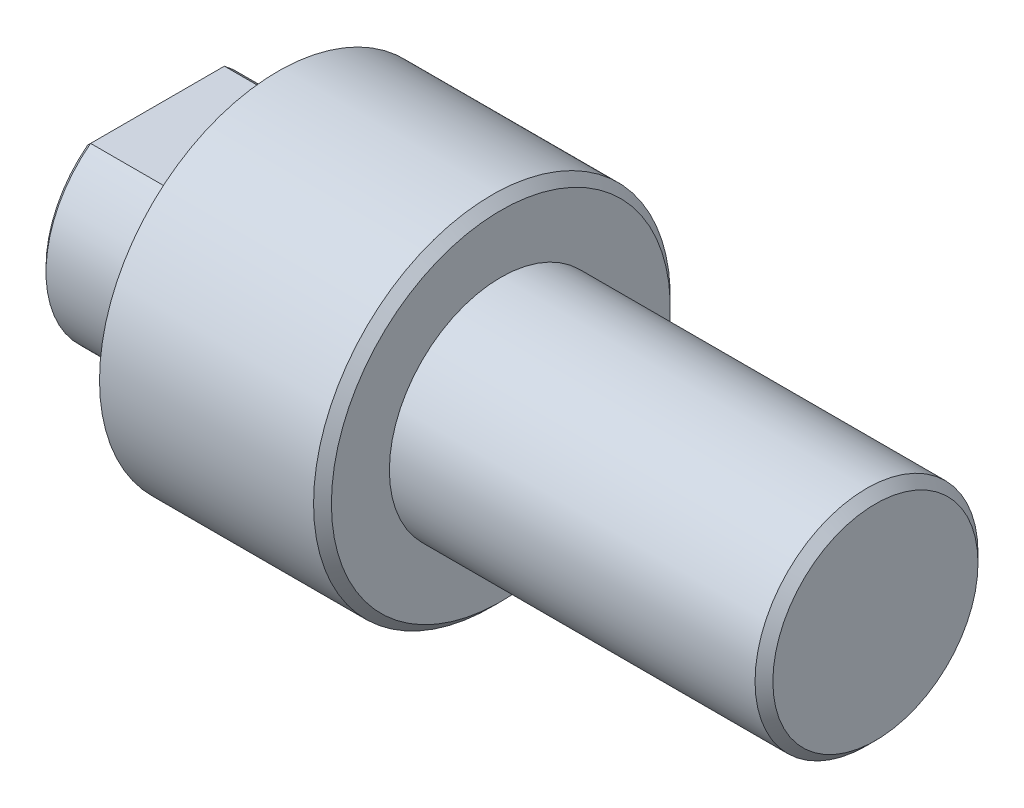
ISO-10303-21;
HEADER;
FILE_DESCRIPTION(('STEP AP214'),'2;1');
FILE_NAME('part.step','',(''),(''),'','','');
FILE_SCHEMA(('AUTOMOTIVE_DESIGN { 1 0 10303 214 1 1 1 1 }'));
ENDSEC;
DATA;
#1=APPLICATION_CONTEXT('core data for automotive mechanical design processes');
#2=APPLICATION_PROTOCOL_DEFINITION('international standard','automotive_design',2000,#1);
#3=PRODUCT_CONTEXT('',#1,'mechanical');
#4=PRODUCT('Part','Part','',(#3));
#5=PRODUCT_RELATED_PRODUCT_CATEGORY('part','',(#4));
#6=PRODUCT_DEFINITION_FORMATION('','',#4);
#7=PRODUCT_DEFINITION_CONTEXT('part definition',#1,'design');
#8=PRODUCT_DEFINITION('design','',#6,#7);
#9=PRODUCT_DEFINITION_SHAPE('','',#8);
#10=(LENGTH_UNIT() NAMED_UNIT(*) SI_UNIT(.MILLI.,.METRE.));
#11=(NAMED_UNIT(*) PLANE_ANGLE_UNIT() SI_UNIT($,.RADIAN.));
#12=(NAMED_UNIT(*) SI_UNIT($,.STERADIAN.) SOLID_ANGLE_UNIT());
#13=UNCERTAINTY_MEASURE_WITH_UNIT(LENGTH_MEASURE(1.E-05),#10,'distance_accuracy_value','');
#14=(GEOMETRIC_REPRESENTATION_CONTEXT(3) GLOBAL_UNCERTAINTY_ASSIGNED_CONTEXT((#13)) GLOBAL_UNIT_ASSIGNED_CONTEXT((#10,
#11,#12)) REPRESENTATION_CONTEXT('',''));
#15=CARTESIAN_POINT('',(0.,0.,0.));
#16=DIRECTION('',(0.,0.,1.));
#17=DIRECTION('',(1.,0.,0.));
#18=AXIS2_PLACEMENT_3D('',#15,#16,#17);
#19=CARTESIAN_POINT('',(0.,0.,0.));
#20=DIRECTION('',(-1.,0.,0.));
#21=DIRECTION('',(0.,0.,1.));
#22=AXIS2_PLACEMENT_3D('',#19,#20,#21);
#23=CYLINDRICAL_SURFACE('',#22,12.5);
#24=DIRECTION('',(-1.,0.,0.));
#25=VECTOR('',#24,1.);
#26=CARTESIAN_POINT('',(29.2069063257455,-10.,-7.49999999999998));
#27=LINE('',#26,#25);
#28=CARTESIAN_POINT('',(14.,-10.,-7.49999999999998));
#29=VERTEX_POINT('',#28);
#30=CARTESIAN_POINT('',(0.499999999999994,-10.,-7.49999999999998));
#31=VERTEX_POINT('',#30);
#32=EDGE_CURVE('E113',#29,#31,#27,.T.);
#33=ORIENTED_EDGE('',*,*,#32,.T.);
#34=CARTESIAN_POINT('',(0.499999999999992,0.,0.));
#35=DIRECTION('',(-1.,0.,0.));
#36=DIRECTION('',(0.,0.,1.));
#37=AXIS2_PLACEMENT_3D('',#34,#35,#36);
#38=CIRCLE('',#37,12.5);
#39=CARTESIAN_POINT('',(0.499999999999994,10.,-7.49999999999998));
#40=VERTEX_POINT('',#39);
#41=EDGE_CURVE('E55',#31,#40,#38,.F.);
#42=ORIENTED_EDGE('',*,*,#41,.T.);
#43=DIRECTION('',(-1.,0.,0.));
#44=VECTOR('',#43,1.);
#45=CARTESIAN_POINT('',(29.2069063257455,10.,-7.49999999999998));
#46=LINE('',#45,#44);
#47=CARTESIAN_POINT('',(14.,10.,-7.49999999999998));
#48=VERTEX_POINT('',#47);
#49=EDGE_CURVE('E120',#48,#40,#46,.T.);
#50=ORIENTED_EDGE('',*,*,#49,.F.);
#51=CARTESIAN_POINT('',(14.,0.,0.));
#52=DIRECTION('',(-1.,0.,0.));
#53=DIRECTION('',(0.,0.,1.));
#54=AXIS2_PLACEMENT_3D('',#51,#52,#53);
#55=CIRCLE('',#54,12.5);
#56=EDGE_CURVE('E128',#48,#29,#55,.T.);
#57=ORIENTED_EDGE('',*,*,#56,.T.);
#58=EDGE_LOOP('',(#33,#42,#50,#57));
#59=FACE_BOUND('',#58,.T.);
#60=ADVANCED_FACE('F40',(#59),#23,.T.);
#61=CARTESIAN_POINT('',(81.,0.,0.));
#62=DIRECTION('',(-1.,0.,0.));
#63=DIRECTION('',(0.,0.,1.));
#64=AXIS2_PLACEMENT_3D('',#61,#62,#63);
#65=PLANE('',#64);
#66=CARTESIAN_POINT('',(81.,0.,0.));
#67=DIRECTION('',(-1.,0.,0.));
#68=DIRECTION('',(0.,0.,1.));
#69=AXIS2_PLACEMENT_3D('',#66,#67,#68);
#70=CIRCLE('',#69,11.5);
#71=CARTESIAN_POINT('',(81.,0.,11.5));
#72=VERTEX_POINT('',#71);
#73=EDGE_CURVE('E11',#72,#72,#70,.F.);
#74=ORIENTED_EDGE('',*,*,#73,.T.);
#75=EDGE_LOOP('',(#74));
#76=FACE_BOUND('',#75,.T.);
#77=ADVANCED_FACE('F209',(#76),#65,.F.);
#78=CARTESIAN_POINT('',(0.,0.,0.));
#79=DIRECTION('',(-1.,0.,0.));
#80=DIRECTION('',(0.,0.,1.));
#81=AXIS2_PLACEMENT_3D('',#78,#79,#80);
#82=CYLINDRICAL_SURFACE('',#81,12.5);
#83=CARTESIAN_POINT('',(80.,0.,0.));
#84=DIRECTION('',(-1.,0.,0.));
#85=DIRECTION('',(0.,0.,1.));
#86=AXIS2_PLACEMENT_3D('',#83,#84,#85);
#87=CIRCLE('',#86,12.5);
#88=CARTESIAN_POINT('',(80.,0.,12.5));
#89=VERTEX_POINT('',#88);
#90=EDGE_CURVE('E48',#89,#89,#87,.T.);
#91=ORIENTED_EDGE('',*,*,#90,.T.);
#92=EDGE_LOOP('',(#91));
#93=FACE_BOUND('',#92,.T.);
#94=CARTESIAN_POINT('',(39.,0.,0.));
#95=DIRECTION('',(-1.,0.,0.));
#96=DIRECTION('',(0.,0.,1.));
#97=AXIS2_PLACEMENT_3D('',#94,#95,#96);
#98=CIRCLE('',#97,12.5);
#99=CARTESIAN_POINT('',(39.,0.,12.5));
#100=VERTEX_POINT('',#99);
#101=EDGE_CURVE('E134',#100,#100,#98,.T.);
#102=ORIENTED_EDGE('',*,*,#101,.F.);
#103=EDGE_LOOP('',(#102));
#104=FACE_BOUND('',#103,.T.);
#105=ADVANCED_FACE('F198',(#93,#104),#82,.T.);
#106=CARTESIAN_POINT('',(39.,0.,0.));
#107=DIRECTION('',(-1.,0.,0.));
#108=DIRECTION('',(0.,0.,1.));
#109=AXIS2_PLACEMENT_3D('',#106,#107,#108);
#110=PLANE('',#109);
#111=CARTESIAN_POINT('',(39.,0.,0.));
#112=DIRECTION('',(-1.,0.,0.));
#113=DIRECTION('',(0.,0.,1.));
#114=AXIS2_PLACEMENT_3D('',#111,#112,#113);
#115=CIRCLE('',#114,19.);
#116=CARTESIAN_POINT('',(39.,0.,19.));
#117=VERTEX_POINT('',#116);
#118=EDGE_CURVE('E193',#117,#117,#115,.F.);
#119=ORIENTED_EDGE('',*,*,#118,.T.);
#120=EDGE_LOOP('',(#119));
#121=FACE_BOUND('',#120,.T.);
#122=ORIENTED_EDGE('',*,*,#101,.T.);
#123=EDGE_LOOP('',(#122));
#124=FACE_BOUND('',#123,.T.);
#125=ADVANCED_FACE('F301',(#121,#124),#110,.F.);
#126=CARTESIAN_POINT('',(0.,0.,0.));
#127=DIRECTION('',(-1.,0.,0.));
#128=DIRECTION('',(0.,0.,1.));
#129=AXIS2_PLACEMENT_3D('',#126,#127,#128);
#130=CYLINDRICAL_SURFACE('',#129,20.);
#131=CARTESIAN_POINT('',(38.,0.,0.));
#132=DIRECTION('',(-1.,0.,0.));
#133=DIRECTION('',(0.,0.,1.));
#134=AXIS2_PLACEMENT_3D('',#131,#132,#133);
#135=CIRCLE('',#134,20.);
#136=CARTESIAN_POINT('',(38.,0.,20.));
#137=VERTEX_POINT('',#136);
#138=EDGE_CURVE('E152',#137,#137,#135,.T.);
#139=ORIENTED_EDGE('',*,*,#138,.T.);
#140=EDGE_LOOP('',(#139));
#141=FACE_BOUND('',#140,.T.);
#142=CARTESIAN_POINT('',(14.,0.,0.));
#143=DIRECTION('',(-1.,0.,0.));
#144=DIRECTION('',(0.,0.,1.));
#145=AXIS2_PLACEMENT_3D('',#142,#143,#144);
#146=CIRCLE('',#145,20.);
#147=CARTESIAN_POINT('',(14.,0.,20.));
#148=VERTEX_POINT('',#147);
#149=EDGE_CURVE('E131',#148,#148,#146,.T.);
#150=ORIENTED_EDGE('',*,*,#149,.F.);
#151=EDGE_LOOP('',(#150));
#152=FACE_BOUND('',#151,.T.);
#153=ADVANCED_FACE('F228',(#141,#152),#130,.T.);
#154=CARTESIAN_POINT('',(14.,0.,0.));
#155=DIRECTION('',(-1.,0.,0.));
#156=DIRECTION('',(0.,0.,1.));
#157=AXIS2_PLACEMENT_3D('',#154,#155,#156);
#158=PLANE('',#157);
#159=ORIENTED_EDGE('',*,*,#149,.T.);
#160=EDGE_LOOP('',(#159));
#161=FACE_BOUND('',#160,.T.);
#162=ORIENTED_EDGE('',*,*,#56,.F.);
#163=DIRECTION('',(0.,0.,-1.));
#164=VECTOR('',#163,1.);
#165=CARTESIAN_POINT('',(14.,10.,0.));
#166=LINE('',#165,#164);
#167=CARTESIAN_POINT('',(14.,10.,7.49999999999998));
#168=VERTEX_POINT('',#167);
#169=EDGE_CURVE('E124',#168,#48,#166,.T.);
#170=ORIENTED_EDGE('',*,*,#169,.F.);
#171=CARTESIAN_POINT('',(14.,-10.,7.49999999999998));
#172=VERTEX_POINT('',#171);
#173=EDGE_CURVE('E127',#172,#168,#55,.T.);
#174=ORIENTED_EDGE('',*,*,#173,.F.);
#175=DIRECTION('',(0.,0.,1.));
#176=VECTOR('',#175,1.);
#177=CARTESIAN_POINT('',(14.,-10.,0.));
#178=LINE('',#177,#176);
#179=EDGE_CURVE('E115',#29,#172,#178,.T.);
#180=ORIENTED_EDGE('',*,*,#179,.F.);
#181=EDGE_LOOP('',(#162,#170,#174,#180));
#182=FACE_BOUND('',#181,.T.);
#183=ADVANCED_FACE('F220',(#161,#182),#158,.T.);
#184=DIRECTION('',(-1.,0.,0.));
#185=VECTOR('',#184,1.);
#186=CARTESIAN_POINT('',(29.2069063257455,10.,7.49999999999998));
#187=LINE('',#186,#185);
#188=CARTESIAN_POINT('',(0.499999999999994,10.,7.49999999999998));
#189=VERTEX_POINT('',#188);
#190=EDGE_CURVE('E121',#168,#189,#187,.T.);
#191=ORIENTED_EDGE('',*,*,#190,.T.);
#192=CARTESIAN_POINT('',(0.499999999999992,0.,0.));
#193=DIRECTION('',(-1.,0.,0.));
#194=DIRECTION('',(0.,0.,1.));
#195=AXIS2_PLACEMENT_3D('',#192,#193,#194);
#196=CIRCLE('',#195,12.5);
#197=CARTESIAN_POINT('',(0.499999999999994,-10.,7.49999999999998));
#198=VERTEX_POINT('',#197);
#199=EDGE_CURVE('E146',#189,#198,#196,.F.);
#200=ORIENTED_EDGE('',*,*,#199,.T.);
#201=DIRECTION('',(-1.,0.,0.));
#202=VECTOR('',#201,1.);
#203=CARTESIAN_POINT('',(29.2069063257455,-10.,7.49999999999998));
#204=LINE('',#203,#202);
#205=EDGE_CURVE('E116',#172,#198,#204,.T.);
#206=ORIENTED_EDGE('',*,*,#205,.F.);
#207=ORIENTED_EDGE('',*,*,#173,.T.);
#208=EDGE_LOOP('',(#191,#200,#206,#207));
#209=FACE_BOUND('',#208,.T.);
#210=ADVANCED_FACE('F211',(#209),#23,.T.);
#211=CARTESIAN_POINT('',(0.,0.,0.));
#212=DIRECTION('',(-1.,0.,0.));
#213=DIRECTION('',(0.,0.,1.));
#214=AXIS2_PLACEMENT_3D('',#211,#212,#213);
#215=PLANE('',#214);
#216=CARTESIAN_POINT('',(0.,0.,0.));
#217=DIRECTION('',(-1.,0.,0.));
#218=DIRECTION('',(0.,0.,1.));
#219=AXIS2_PLACEMENT_3D('',#216,#217,#218);
#220=CIRCLE('',#219,5.1);
#221=CARTESIAN_POINT('',(0.,0.,5.1));
#222=VERTEX_POINT('',#221);
#223=EDGE_CURVE('E106',#222,#222,#220,.T.);
#224=ORIENTED_EDGE('',*,*,#223,.F.);
#225=EDGE_LOOP('',(#224));
#226=FACE_BOUND('',#225,.T.);
#227=DIRECTION('',(0.,0.,1.));
#228=VECTOR('',#227,1.);
#229=CARTESIAN_POINT('',(0.,-9.5,7.49999999999998));
#230=LINE('',#229,#228);
#231=CARTESIAN_POINT('',(0.,-9.5,-7.33143914930757));
#232=VERTEX_POINT('',#231);
#233=CARTESIAN_POINT('',(0.,-9.5,7.33143914930757));
#234=VERTEX_POINT('',#233);
#235=EDGE_CURVE('E141',#232,#234,#230,.T.);
#236=ORIENTED_EDGE('',*,*,#235,.T.);
#237=CARTESIAN_POINT('',(0.,0.,0.));
#238=DIRECTION('',(-1.,0.,0.));
#239=DIRECTION('',(0.,0.,1.));
#240=AXIS2_PLACEMENT_3D('',#237,#238,#239);
#241=CIRCLE('',#240,12.);
#242=CARTESIAN_POINT('',(0.,9.5,7.33143914930757));
#243=VERTEX_POINT('',#242);
#244=EDGE_CURVE('E143',#234,#243,#241,.T.);
#245=ORIENTED_EDGE('',*,*,#244,.T.);
#246=DIRECTION('',(0.,0.,-1.));
#247=VECTOR('',#246,1.);
#248=CARTESIAN_POINT('',(0.,9.5,-7.49999999999998));
#249=LINE('',#248,#247);
#250=CARTESIAN_POINT('',(0.,9.5,-7.33143914930757));
#251=VERTEX_POINT('',#250);
#252=EDGE_CURVE('E139',#243,#251,#249,.T.);
#253=ORIENTED_EDGE('',*,*,#252,.T.);
#254=CARTESIAN_POINT('',(0.,0.,0.));
#255=DIRECTION('',(-1.,0.,0.));
#256=DIRECTION('',(0.,0.,1.));
#257=AXIS2_PLACEMENT_3D('',#254,#255,#256);
#258=CIRCLE('',#257,12.);
#259=EDGE_CURVE('E137',#251,#232,#258,.T.);
#260=ORIENTED_EDGE('',*,*,#259,.T.);
#261=EDGE_LOOP('',(#236,#245,#253,#260));
#262=FACE_BOUND('',#261,.T.);
#263=ADVANCED_FACE('F219',(#226,#262),#215,.T.);
#264=CARTESIAN_POINT('',(29.2069063257455,10.,0.));
#265=DIRECTION('',(0.,-1.,0.));
#266=DIRECTION('',(0.,0.,-1.));
#267=AXIS2_PLACEMENT_3D('',#264,#265,#266);
#268=PLANE('',#267);
#269=ORIENTED_EDGE('',*,*,#49,.T.);
#270=DIRECTION('',(0.,0.,1.));
#271=VECTOR('',#270,1.);
#272=CARTESIAN_POINT('',(0.499999999999994,10.,7.49999999999998));
#273=LINE('',#272,#271);
#274=EDGE_CURVE('E150',#40,#189,#273,.T.);
#275=ORIENTED_EDGE('',*,*,#274,.T.);
#276=ORIENTED_EDGE('',*,*,#190,.F.);
#277=ORIENTED_EDGE('',*,*,#169,.T.);
#278=EDGE_LOOP('',(#269,#275,#276,#277));
#279=FACE_BOUND('',#278,.T.);
#280=ADVANCED_FACE('F226',(#279),#268,.F.);
#281=CARTESIAN_POINT('',(29.2069063257455,-10.,0.));
#282=DIRECTION('',(0.,1.,0.));
#283=DIRECTION('',(0.,0.,1.));
#284=AXIS2_PLACEMENT_3D('',#281,#282,#283);
#285=PLANE('',#284);
#286=ORIENTED_EDGE('',*,*,#205,.T.);
#287=DIRECTION('',(0.,0.,-1.));
#288=VECTOR('',#287,1.);
#289=CARTESIAN_POINT('',(0.499999999999994,-10.,-7.49999999999998));
#290=LINE('',#289,#288);
#291=EDGE_CURVE('E63',#198,#31,#290,.T.);
#292=ORIENTED_EDGE('',*,*,#291,.T.);
#293=ORIENTED_EDGE('',*,*,#32,.F.);
#294=ORIENTED_EDGE('',*,*,#179,.T.);
#295=EDGE_LOOP('',(#286,#292,#293,#294));
#296=FACE_BOUND('',#295,.T.);
#297=ADVANCED_FACE('F250',(#296),#285,.F.);
#298=CARTESIAN_POINT('',(0.,0.,0.));
#299=DIRECTION('',(1.,0.,0.));
#300=DIRECTION('',(0.,0.,-1.));
#301=AXIS2_PLACEMENT_3D('',#298,#299,#300);
#302=CONICAL_SURFACE('',#301,12.,0.78539816339746);
#303=CARTESIAN_POINT('',(0.,9.5,-7.33143914930757));
#304=CARTESIAN_POINT('',(0.0832824124492942,9.58328241244929,-7.35983473393856));
#305=CARTESIAN_POINT('',(0.166590286738523,9.66659028673852,-7.38807926427767));
#306=CARTESIAN_POINT('',(0.333256953408602,9.83325695340861,-7.44426621448821));
#307=CARTESIAN_POINT('',(0.416615745786037,9.91661574578604,-7.47220863437991));
#308=CARTESIAN_POINT('',(0.499999999999992,10.,-7.49999999999998));
#309=B_SPLINE_CURVE_WITH_KNOTS('',3,(#303,#304,#305,#306,#307,#308),.UNSPECIFIED.,.F.,.F.,(4,2,
4),(0.,0.363460336187203,0.726920648001125),.UNSPECIFIED.);
#310=EDGE_CURVE('E187',#40,#251,#309,.F.);
#311=ORIENTED_EDGE('',*,*,#310,.F.);
#312=ORIENTED_EDGE('',*,*,#41,.F.);
#313=CARTESIAN_POINT('',(0.499999999999993,-10.,-7.49999999999998));
#314=CARTESIAN_POINT('',(0.416615745786037,-9.91661574578604,-7.47220863437991));
#315=CARTESIAN_POINT('',(0.333256953408602,-9.83325695340861,-7.44426621448821));
#316=CARTESIAN_POINT('',(0.166590286738523,-9.66659028673852,-7.38807926427767));
#317=CARTESIAN_POINT('',(0.0832824124492941,-9.58328241244929,-7.35983473393856));
#318=CARTESIAN_POINT('',(0.,-9.5,-7.33143914930757));
#319=B_SPLINE_CURVE_WITH_KNOTS('',3,(#313,#314,#315,#316,#317,#318),.UNSPECIFIED.,.F.,.F.,(4,2,
4),(0.,0.363460311813923,0.726920648001126),.UNSPECIFIED.);
#320=EDGE_CURVE('E118',#232,#31,#319,.F.);
#321=ORIENTED_EDGE('',*,*,#320,.F.);
#322=ORIENTED_EDGE('',*,*,#259,.F.);
#323=EDGE_LOOP('',(#311,#312,#321,#322));
#324=FACE_BOUND('',#323,.T.);
#325=ADVANCED_FACE('F177',(#324),#302,.T.);
#326=CARTESIAN_POINT('',(0.499999999999994,-10.,0.));
#327=DIRECTION('',(-0.707106781186555,-0.70710678118654,0.));
#328=DIRECTION('',(0.,0.,1.));
#329=AXIS2_PLACEMENT_3D('',#326,#327,#328);
#330=PLANE('',#329);
#331=ORIENTED_EDGE('',*,*,#320,.T.);
#332=ORIENTED_EDGE('',*,*,#291,.F.);
#333=CARTESIAN_POINT('',(0.499999999999993,-10.,7.49999999999998));
#334=CARTESIAN_POINT('',(0.416615745786037,-9.91661574578604,7.47220863437991));
#335=CARTESIAN_POINT('',(0.333256953408602,-9.83325695340861,7.44426621448821));
#336=CARTESIAN_POINT('',(0.166590286738523,-9.66659028673852,7.38807926427767));
#337=CARTESIAN_POINT('',(0.0832824124492941,-9.58328241244929,7.35983473393856));
#338=CARTESIAN_POINT('',(0.,-9.5,7.33143914930757));
#339=B_SPLINE_CURVE_WITH_KNOTS('',3,(#333,#334,#335,#336,#337,#338),.UNSPECIFIED.,.F.,.F.,(4,2,
4),(0.,0.363460311813923,0.726920648001126),.UNSPECIFIED.);
#340=EDGE_CURVE('E108',#234,#198,#339,.F.);
#341=ORIENTED_EDGE('',*,*,#340,.F.);
#342=ORIENTED_EDGE('',*,*,#235,.F.);
#343=EDGE_LOOP('',(#331,#332,#341,#342));
#344=FACE_BOUND('',#343,.T.);
#345=ADVANCED_FACE('F172',(#344),#330,.T.);
#346=CARTESIAN_POINT('',(0.499999999999994,10.,0.));
#347=DIRECTION('',(-0.707106781186555,0.70710678118654,0.));
#348=DIRECTION('',(0.,0.,-1.));
#349=AXIS2_PLACEMENT_3D('',#346,#347,#348);
#350=PLANE('',#349);
#351=ORIENTED_EDGE('',*,*,#310,.T.);
#352=ORIENTED_EDGE('',*,*,#252,.F.);
#353=CARTESIAN_POINT('',(0.,9.5,7.33143914930757));
#354=CARTESIAN_POINT('',(0.0832824124492942,9.58328241244929,7.35983473393856));
#355=CARTESIAN_POINT('',(0.166590286738523,9.66659028673852,7.38807926427767));
#356=CARTESIAN_POINT('',(0.333256953408602,9.83325695340861,7.44426621448821));
#357=CARTESIAN_POINT('',(0.416615745786037,9.91661574578604,7.47220863437991));
#358=CARTESIAN_POINT('',(0.499999999999992,10.,7.49999999999998));
#359=B_SPLINE_CURVE_WITH_KNOTS('',3,(#353,#354,#355,#356,#357,#358),.UNSPECIFIED.,.F.,.F.,(4,2,
4),(0.,0.363460336187203,0.726920648001125),.UNSPECIFIED.);
#360=EDGE_CURVE('E105',#189,#243,#359,.F.);
#361=ORIENTED_EDGE('',*,*,#360,.F.);
#362=ORIENTED_EDGE('',*,*,#274,.F.);
#363=EDGE_LOOP('',(#351,#352,#361,#362));
#364=FACE_BOUND('',#363,.T.);
#365=ADVANCED_FACE('F164',(#364),#350,.T.);
#366=CARTESIAN_POINT('',(0.,0.,0.));
#367=DIRECTION('',(1.,0.,0.));
#368=DIRECTION('',(0.,0.,-1.));
#369=AXIS2_PLACEMENT_3D('',#366,#367,#368);
#370=CONICAL_SURFACE('',#369,12.,0.78539816339746);
#371=ORIENTED_EDGE('',*,*,#340,.T.);
#372=ORIENTED_EDGE('',*,*,#199,.F.);
#373=ORIENTED_EDGE('',*,*,#360,.T.);
#374=ORIENTED_EDGE('',*,*,#244,.F.);
#375=EDGE_LOOP('',(#371,#372,#373,#374));
#376=FACE_BOUND('',#375,.T.);
#377=ADVANCED_FACE('F167',(#376),#370,.T.);
#378=CARTESIAN_POINT('',(38.,0.,0.));
#379=DIRECTION('',(-1.,0.,0.));
#380=DIRECTION('',(0.,0.,1.));
#381=AXIS2_PLACEMENT_3D('',#378,#379,#380);
#382=CONICAL_SURFACE('',#381,20.,0.785398163397447);
#383=ORIENTED_EDGE('',*,*,#118,.F.);
#384=EDGE_LOOP('',(#383));
#385=FACE_BOUND('',#384,.T.);
#386=ORIENTED_EDGE('',*,*,#138,.F.);
#387=EDGE_LOOP('',(#386));
#388=FACE_BOUND('',#387,.T.);
#389=ADVANCED_FACE('F170',(#385,#388),#382,.T.);
#390=CARTESIAN_POINT('',(80.,0.,0.));
#391=DIRECTION('',(-1.,0.,0.));
#392=DIRECTION('',(0.,0.,1.));
#393=AXIS2_PLACEMENT_3D('',#390,#391,#392);
#394=CONICAL_SURFACE('',#393,12.5,0.785398163397439);
#395=ORIENTED_EDGE('',*,*,#73,.F.);
#396=EDGE_LOOP('',(#395));
#397=FACE_BOUND('',#396,.T.);
#398=ORIENTED_EDGE('',*,*,#90,.F.);
#399=EDGE_LOOP('',(#398));
#400=FACE_BOUND('',#399,.T.);
#401=ADVANCED_FACE('F42',(#397,#400),#394,.T.);
#402=CARTESIAN_POINT('',(32.75,0.,0.));
#403=DIRECTION('',(-1.,0.,0.));
#404=DIRECTION('',(0.,0.,1.));
#405=AXIS2_PLACEMENT_3D('',#402,#403,#404);
#406=CONICAL_SURFACE('',#405,5.1,1.02974425867665);
#407=CARTESIAN_POINT('',(35.8143891570406,0.,0.));
#408=VERTEX_POINT('',#407);
#409=VERTEX_LOOP('',#408);
#410=FACE_BOUND('',#409,.T.);
#411=CARTESIAN_POINT('',(32.75,0.,0.));
#412=DIRECTION('',(-1.,0.,0.));
#413=DIRECTION('',(0.,0.,1.));
#414=AXIS2_PLACEMENT_3D('',#411,#412,#413);
#415=CIRCLE('',#414,5.1);
#416=CARTESIAN_POINT('',(32.75,0.,5.1));
#417=VERTEX_POINT('',#416);
#418=EDGE_CURVE('E103',#417,#417,#415,.T.);
#419=ORIENTED_EDGE('',*,*,#418,.T.);
#420=EDGE_LOOP('',(#419));
#421=FACE_BOUND('',#420,.T.);
#422=ADVANCED_FACE('F96',(#410,#421),#406,.F.);
#423=CARTESIAN_POINT('',(0.,0.,0.));
#424=DIRECTION('',(-1.,0.,0.));
#425=DIRECTION('',(0.,0.,1.));
#426=AXIS2_PLACEMENT_3D('',#423,#424,#425);
#427=CYLINDRICAL_SURFACE('',#426,5.1);
#428=ORIENTED_EDGE('',*,*,#418,.F.);
#429=EDGE_LOOP('',(#428));
#430=FACE_BOUND('',#429,.T.);
#431=ORIENTED_EDGE('',*,*,#223,.T.);
#432=EDGE_LOOP('',(#431));
#433=FACE_BOUND('',#432,.T.);
#434=ADVANCED_FACE('F99',(#430,#433),#427,.F.);
#435=CLOSED_SHELL('',(#60,#77,#105,#125,#153,#183,#210,#263,#280,#297,#325,#345,#365,#377,#389,
#401,#422,#434));
#436=MANIFOLD_SOLID_BREP('B2',#435);
#437=ADVANCED_BREP_SHAPE_REPRESENTATION('',(#18,#436),#14);
#438=SHAPE_DEFINITION_REPRESENTATION(#9,#437);
ENDSEC;
END-ISO-10303-21;
